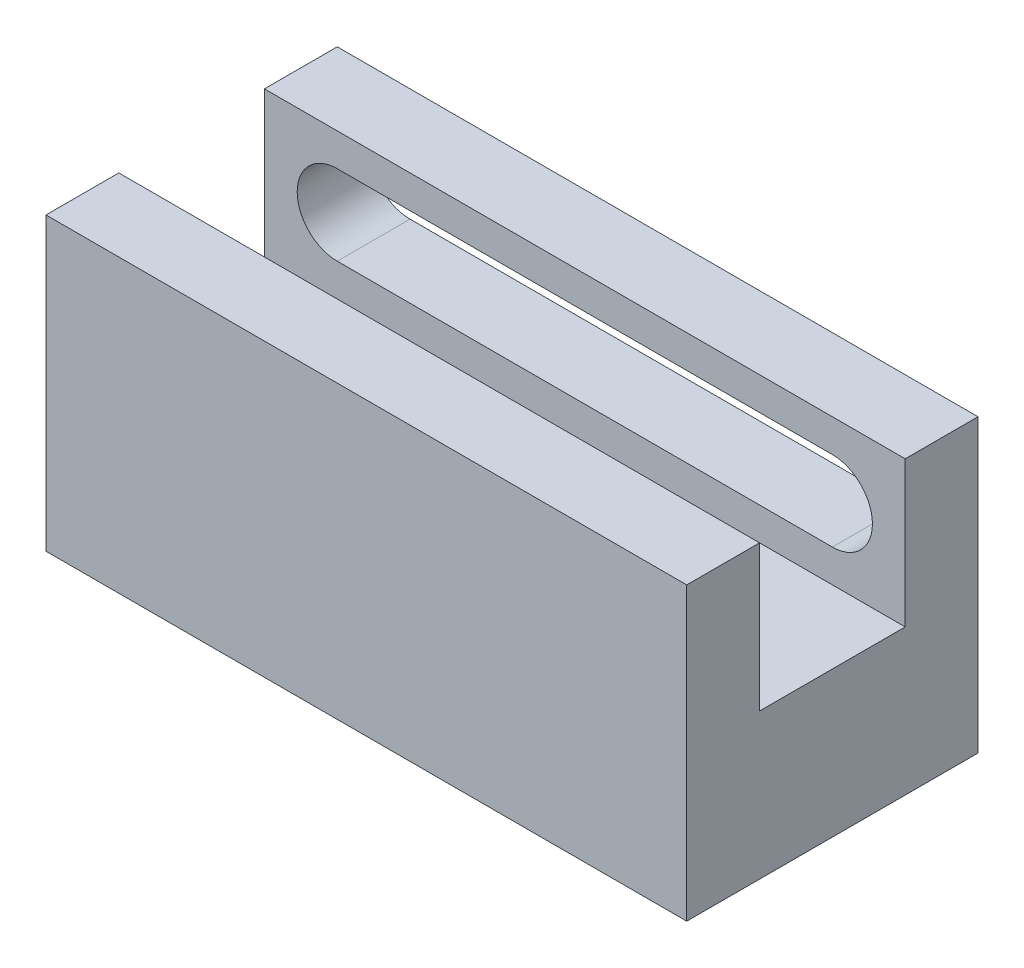
ISO-10303-21;
HEADER;
FILE_DESCRIPTION(('STEP AP214'),'2;1');
FILE_NAME('part.step','',(''),(''),'','','');
FILE_SCHEMA(('AUTOMOTIVE_DESIGN { 1 0 10303 214 1 1 1 1 }'));
ENDSEC;
DATA;
#1=APPLICATION_CONTEXT('core data for automotive mechanical design processes');
#2=APPLICATION_PROTOCOL_DEFINITION('international standard','automotive_design',2000,#1);
#3=PRODUCT_CONTEXT('',#1,'mechanical');
#4=PRODUCT('Part','Part','',(#3));
#5=PRODUCT_RELATED_PRODUCT_CATEGORY('part','',(#4));
#6=PRODUCT_DEFINITION_FORMATION('','',#4);
#7=PRODUCT_DEFINITION_CONTEXT('part definition',#1,'design');
#8=PRODUCT_DEFINITION('design','',#6,#7);
#9=PRODUCT_DEFINITION_SHAPE('','',#8);
#10=(LENGTH_UNIT() NAMED_UNIT(*) SI_UNIT(.MILLI.,.METRE.));
#11=(NAMED_UNIT(*) PLANE_ANGLE_UNIT() SI_UNIT($,.RADIAN.));
#12=(NAMED_UNIT(*) SI_UNIT($,.STERADIAN.) SOLID_ANGLE_UNIT());
#13=UNCERTAINTY_MEASURE_WITH_UNIT(LENGTH_MEASURE(1.E-05),#10,'distance_accuracy_value','');
#14=(GEOMETRIC_REPRESENTATION_CONTEXT(3) GLOBAL_UNCERTAINTY_ASSIGNED_CONTEXT((#13)) GLOBAL_UNIT_ASSIGNED_CONTEXT((#10,
#11,#12)) REPRESENTATION_CONTEXT('',''));
#15=CARTESIAN_POINT('',(0.,0.,0.));
#16=DIRECTION('',(0.,0.,1.));
#17=DIRECTION('',(1.,0.,0.));
#18=AXIS2_PLACEMENT_3D('',#15,#16,#17);
#19=CARTESIAN_POINT('',(0.,10.,0.));
#20=DIRECTION('',(0.,1.,0.));
#21=DIRECTION('',(0.,0.,1.));
#22=AXIS2_PLACEMENT_3D('',#19,#20,#21);
#23=PLANE('',#22);
#24=DIRECTION('',(0.,0.,-1.));
#25=VECTOR('',#24,1.);
#26=CARTESIAN_POINT('',(44.,10.,0.));
#27=LINE('',#26,#25);
#28=CARTESIAN_POINT('',(44.,10.,-4.99999999999999));
#29=VERTEX_POINT('',#28);
#30=CARTESIAN_POINT('',(44.,10.,-15.));
#31=VERTEX_POINT('',#30);
#32=EDGE_CURVE('E140',#29,#31,#27,.T.);
#33=ORIENTED_EDGE('',*,*,#32,.T.);
#34=DIRECTION('',(1.,0.,0.));
#35=VECTOR('',#34,1.);
#36=CARTESIAN_POINT('',(44.,10.,-15.));
#37=LINE('',#36,#35);
#38=CARTESIAN_POINT('',(0.,10.,-15.));
#39=VERTEX_POINT('',#38);
#40=EDGE_CURVE('E149',#39,#31,#37,.T.);
#41=ORIENTED_EDGE('',*,*,#40,.F.);
#42=DIRECTION('',(0.,0.,1.));
#43=VECTOR('',#42,1.);
#44=CARTESIAN_POINT('',(0.,10.,0.));
#45=LINE('',#44,#43);
#46=CARTESIAN_POINT('',(0.,10.,-4.99999999999999));
#47=VERTEX_POINT('',#46);
#48=EDGE_CURVE('E142',#39,#47,#45,.T.);
#49=ORIENTED_EDGE('',*,*,#48,.T.);
#50=DIRECTION('',(-1.,0.,0.));
#51=VECTOR('',#50,1.);
#52=CARTESIAN_POINT('',(0.,10.,-4.99999999999999));
#53=LINE('',#52,#51);
#54=EDGE_CURVE('E137',#29,#47,#53,.T.);
#55=ORIENTED_EDGE('',*,*,#54,.F.);
#56=EDGE_LOOP('',(#33,#41,#49,#55));
#57=FACE_BOUND('',#56,.T.);
#58=ADVANCED_FACE('F42',(#57),#23,.T.);
#59=CARTESIAN_POINT('',(0.,0.,0.));
#60=DIRECTION('',(0.,1.,0.));
#61=DIRECTION('',(0.,0.,1.));
#62=AXIS2_PLACEMENT_3D('',#59,#60,#61);
#63=PLANE('',#62);
#64=DIRECTION('',(0.,0.,1.));
#65=VECTOR('',#64,1.);
#66=CARTESIAN_POINT('',(0.,0.,-20.));
#67=LINE('',#66,#65);
#68=CARTESIAN_POINT('',(0.,0.,-20.));
#69=VERTEX_POINT('',#68);
#70=CARTESIAN_POINT('',(0.,0.,0.));
#71=VERTEX_POINT('',#70);
#72=EDGE_CURVE('E180',#69,#71,#67,.T.);
#73=ORIENTED_EDGE('',*,*,#72,.F.);
#74=DIRECTION('',(-1.,0.,0.));
#75=VECTOR('',#74,1.);
#76=CARTESIAN_POINT('',(0.,0.,-20.));
#77=LINE('',#76,#75);
#78=CARTESIAN_POINT('',(44.,0.,-20.));
#79=VERTEX_POINT('',#78);
#80=EDGE_CURVE('E190',#79,#69,#77,.T.);
#81=ORIENTED_EDGE('',*,*,#80,.F.);
#82=DIRECTION('',(0.,0.,-1.));
#83=VECTOR('',#82,1.);
#84=CARTESIAN_POINT('',(44.,0.,-20.));
#85=LINE('',#84,#83);
#86=CARTESIAN_POINT('',(44.,0.,0.));
#87=VERTEX_POINT('',#86);
#88=EDGE_CURVE('E187',#87,#79,#85,.T.);
#89=ORIENTED_EDGE('',*,*,#88,.F.);
#90=DIRECTION('',(1.,0.,0.));
#91=VECTOR('',#90,1.);
#92=CARTESIAN_POINT('',(0.,0.,0.));
#93=LINE('',#92,#91);
#94=EDGE_CURVE('E184',#71,#87,#93,.T.);
#95=ORIENTED_EDGE('',*,*,#94,.F.);
#96=EDGE_LOOP('',(#73,#81,#89,#95));
#97=FACE_BOUND('',#96,.T.);
#98=CARTESIAN_POINT('',(22.,0.,-10.));
#99=DIRECTION('',(0.,1.,0.));
#100=DIRECTION('',(0.,0.,1.));
#101=AXIS2_PLACEMENT_3D('',#98,#99,#100);
#102=CIRCLE('',#101,2.55);
#103=CARTESIAN_POINT('',(22.,0.,-7.45));
#104=VERTEX_POINT('',#103);
#105=EDGE_CURVE('E176',#104,#104,#102,.T.);
#106=ORIENTED_EDGE('',*,*,#105,.T.);
#107=EDGE_LOOP('',(#106));
#108=FACE_BOUND('',#107,.T.);
#109=ADVANCED_FACE('F263',(#97,#108),#63,.F.);
#110=CARTESIAN_POINT('',(0.,7.5,-20.));
#111=DIRECTION('',(1.,0.,0.));
#112=DIRECTION('',(0.,0.,-1.));
#113=AXIS2_PLACEMENT_3D('',#110,#111,#112);
#114=PLANE('',#113);
#115=ORIENTED_EDGE('',*,*,#72,.T.);
#116=DIRECTION('',(0.,-1.,0.));
#117=VECTOR('',#116,1.);
#118=CARTESIAN_POINT('',(0.,7.5,0.));
#119=LINE('',#118,#117);
#120=CARTESIAN_POINT('',(0.,20.,0.));
#121=VERTEX_POINT('',#120);
#122=EDGE_CURVE('E11',#121,#71,#119,.T.);
#123=ORIENTED_EDGE('',*,*,#122,.F.);
#124=DIRECTION('',(0.,0.,1.));
#125=VECTOR('',#124,1.);
#126=CARTESIAN_POINT('',(0.,20.,-4.99999999999999));
#127=LINE('',#126,#125);
#128=CARTESIAN_POINT('',(0.,20.,-4.99999999999999));
#129=VERTEX_POINT('',#128);
#130=EDGE_CURVE('E148',#129,#121,#127,.T.);
#131=ORIENTED_EDGE('',*,*,#130,.F.);
#132=DIRECTION('',(0.,-1.,0.));
#133=VECTOR('',#132,1.);
#134=CARTESIAN_POINT('',(0.,20.,-4.99999999999999));
#135=LINE('',#134,#133);
#136=EDGE_CURVE('E165',#129,#47,#135,.T.);
#137=ORIENTED_EDGE('',*,*,#136,.T.);
#138=ORIENTED_EDGE('',*,*,#48,.F.);
#139=DIRECTION('',(0.,-1.,0.));
#140=VECTOR('',#139,1.);
#141=CARTESIAN_POINT('',(0.,20.,-15.));
#142=LINE('',#141,#140);
#143=CARTESIAN_POINT('',(0.,20.,-15.));
#144=VERTEX_POINT('',#143);
#145=EDGE_CURVE('E213',#144,#39,#142,.T.);
#146=ORIENTED_EDGE('',*,*,#145,.F.);
#147=DIRECTION('',(0.,0.,1.));
#148=VECTOR('',#147,1.);
#149=CARTESIAN_POINT('',(0.,20.,-15.));
#150=LINE('',#149,#148);
#151=CARTESIAN_POINT('',(0.,20.,-20.));
#152=VERTEX_POINT('',#151);
#153=EDGE_CURVE('E232',#152,#144,#150,.T.);
#154=ORIENTED_EDGE('',*,*,#153,.F.);
#155=DIRECTION('',(0.,-1.,0.));
#156=VECTOR('',#155,1.);
#157=CARTESIAN_POINT('',(0.,7.5,-20.));
#158=LINE('',#157,#156);
#159=EDGE_CURVE('E193',#152,#69,#158,.T.);
#160=ORIENTED_EDGE('',*,*,#159,.T.);
#161=EDGE_LOOP('',(#115,#123,#131,#137,#138,#146,#154,#160));
#162=FACE_BOUND('',#161,.T.);
#163=ADVANCED_FACE('F44',(#162),#114,.F.);
#164=CARTESIAN_POINT('',(0.,7.5,0.));
#165=DIRECTION('',(0.,0.,-1.));
#166=DIRECTION('',(-1.,0.,0.));
#167=AXIS2_PLACEMENT_3D('',#164,#165,#166);
#168=PLANE('',#167);
#169=ORIENTED_EDGE('',*,*,#94,.T.);
#170=DIRECTION('',(0.,-1.,0.));
#171=VECTOR('',#170,1.);
#172=CARTESIAN_POINT('',(44.,7.5,0.));
#173=LINE('',#172,#171);
#174=CARTESIAN_POINT('',(44.,20.,0.));
#175=VERTEX_POINT('',#174);
#176=EDGE_CURVE('E52',#175,#87,#173,.T.);
#177=ORIENTED_EDGE('',*,*,#176,.F.);
#178=DIRECTION('',(1.,0.,0.));
#179=VECTOR('',#178,1.);
#180=CARTESIAN_POINT('',(0.,20.,0.));
#181=LINE('',#180,#179);
#182=EDGE_CURVE('E244',#121,#175,#181,.T.);
#183=ORIENTED_EDGE('',*,*,#182,.F.);
#184=ORIENTED_EDGE('',*,*,#122,.T.);
#185=EDGE_LOOP('',(#169,#177,#183,#184));
#186=FACE_BOUND('',#185,.T.);
#187=ADVANCED_FACE('F259',(#186),#168,.F.);
#188=CARTESIAN_POINT('',(44.,7.5,-20.));
#189=DIRECTION('',(-1.,0.,0.));
#190=DIRECTION('',(0.,0.,1.));
#191=AXIS2_PLACEMENT_3D('',#188,#189,#190);
#192=PLANE('',#191);
#193=ORIENTED_EDGE('',*,*,#88,.T.);
#194=DIRECTION('',(0.,-1.,0.));
#195=VECTOR('',#194,1.);
#196=CARTESIAN_POINT('',(44.,7.5,-20.));
#197=LINE('',#196,#195);
#198=CARTESIAN_POINT('',(44.,20.,-20.));
#199=VERTEX_POINT('',#198);
#200=EDGE_CURVE('E197',#199,#79,#197,.T.);
#201=ORIENTED_EDGE('',*,*,#200,.F.);
#202=DIRECTION('',(0.,0.,-1.));
#203=VECTOR('',#202,1.);
#204=CARTESIAN_POINT('',(44.,20.,-15.));
#205=LINE('',#204,#203);
#206=CARTESIAN_POINT('',(44.,20.,-15.));
#207=VERTEX_POINT('',#206);
#208=EDGE_CURVE('E229',#207,#199,#205,.T.);
#209=ORIENTED_EDGE('',*,*,#208,.F.);
#210=DIRECTION('',(0.,-1.,0.));
#211=VECTOR('',#210,1.);
#212=CARTESIAN_POINT('',(44.,20.,-15.));
#213=LINE('',#212,#211);
#214=EDGE_CURVE('E159',#207,#31,#213,.T.);
#215=ORIENTED_EDGE('',*,*,#214,.T.);
#216=ORIENTED_EDGE('',*,*,#32,.F.);
#217=DIRECTION('',(0.,-1.,0.));
#218=VECTOR('',#217,1.);
#219=CARTESIAN_POINT('',(44.,20.,-4.99999999999999));
#220=LINE('',#219,#218);
#221=CARTESIAN_POINT('',(44.,20.,-4.99999999999999));
#222=VERTEX_POINT('',#221);
#223=EDGE_CURVE('E156',#222,#29,#220,.T.);
#224=ORIENTED_EDGE('',*,*,#223,.F.);
#225=DIRECTION('',(0.,0.,-1.));
#226=VECTOR('',#225,1.);
#227=CARTESIAN_POINT('',(44.,20.,-4.99999999999999));
#228=LINE('',#227,#226);
#229=EDGE_CURVE('E248',#175,#222,#228,.T.);
#230=ORIENTED_EDGE('',*,*,#229,.F.);
#231=ORIENTED_EDGE('',*,*,#176,.T.);
#232=EDGE_LOOP('',(#193,#201,#209,#215,#216,#224,#230,#231));
#233=FACE_BOUND('',#232,.T.);
#234=ADVANCED_FACE('F154',(#233),#192,.F.);
#235=CARTESIAN_POINT('',(0.,7.5,-20.));
#236=DIRECTION('',(0.,0.,1.));
#237=DIRECTION('',(1.,0.,0.));
#238=AXIS2_PLACEMENT_3D('',#235,#236,#237);
#239=PLANE('',#238);
#240=CARTESIAN_POINT('',(5.,15.,-20.));
#241=DIRECTION('',(0.,0.,-1.));
#242=DIRECTION('',(-1.,0.,0.));
#243=AXIS2_PLACEMENT_3D('',#240,#241,#242);
#244=CIRCLE('',#243,2.75);
#245=CARTESIAN_POINT('',(5.,12.25,-20.));
#246=VERTEX_POINT('',#245);
#247=CARTESIAN_POINT('',(5.,17.75,-20.));
#248=VERTEX_POINT('',#247);
#249=EDGE_CURVE('E204',#246,#248,#244,.T.);
#250=ORIENTED_EDGE('',*,*,#249,.F.);
#251=DIRECTION('',(1.,0.,0.));
#252=VECTOR('',#251,1.);
#253=CARTESIAN_POINT('',(0.,12.25,-20.));
#254=LINE('',#253,#252);
#255=CARTESIAN_POINT('',(39.,12.25,-20.));
#256=VERTEX_POINT('',#255);
#257=EDGE_CURVE('E46',#256,#246,#254,.F.);
#258=ORIENTED_EDGE('',*,*,#257,.F.);
#259=CARTESIAN_POINT('',(39.,15.,-20.));
#260=DIRECTION('',(0.,0.,-1.));
#261=DIRECTION('',(-1.,0.,0.));
#262=AXIS2_PLACEMENT_3D('',#259,#260,#261);
#263=CIRCLE('',#262,2.74999999999999);
#264=CARTESIAN_POINT('',(39.,17.75,-20.));
#265=VERTEX_POINT('',#264);
#266=EDGE_CURVE('E85',#265,#256,#263,.T.);
#267=ORIENTED_EDGE('',*,*,#266,.F.);
#268=DIRECTION('',(1.,0.,0.));
#269=VECTOR('',#268,1.);
#270=CARTESIAN_POINT('',(0.,17.75,-20.));
#271=LINE('',#270,#269);
#272=EDGE_CURVE('E207',#265,#248,#271,.F.);
#273=ORIENTED_EDGE('',*,*,#272,.T.);
#274=EDGE_LOOP('',(#250,#258,#267,#273));
#275=FACE_BOUND('',#274,.T.);
#276=ORIENTED_EDGE('',*,*,#80,.T.);
#277=ORIENTED_EDGE('',*,*,#159,.F.);
#278=DIRECTION('',(-1.,0.,0.));
#279=VECTOR('',#278,1.);
#280=CARTESIAN_POINT('',(44.,20.,-20.));
#281=LINE('',#280,#279);
#282=EDGE_CURVE('E235',#199,#152,#281,.T.);
#283=ORIENTED_EDGE('',*,*,#282,.F.);
#284=ORIENTED_EDGE('',*,*,#200,.T.);
#285=EDGE_LOOP('',(#276,#277,#283,#284));
#286=FACE_BOUND('',#285,.T.);
#287=ADVANCED_FACE('F266',(#275,#286),#239,.F.);
#288=CARTESIAN_POINT('',(22.,7.5,-10.));
#289=DIRECTION('',(0.,-1.,0.));
#290=DIRECTION('',(0.,0.,-1.));
#291=AXIS2_PLACEMENT_3D('',#288,#289,#290);
#292=CYLINDRICAL_SURFACE('',#291,2.55);
#293=CARTESIAN_POINT('',(22.,7.5,-10.));
#294=DIRECTION('',(0.,1.,0.));
#295=DIRECTION('',(0.,0.,1.));
#296=AXIS2_PLACEMENT_3D('',#293,#294,#295);
#297=CIRCLE('',#296,2.55);
#298=CARTESIAN_POINT('',(22.,7.5,-7.45));
#299=VERTEX_POINT('',#298);
#300=EDGE_CURVE('E172',#299,#299,#297,.T.);
#301=ORIENTED_EDGE('',*,*,#300,.T.);
#302=EDGE_LOOP('',(#301));
#303=FACE_BOUND('',#302,.T.);
#304=ORIENTED_EDGE('',*,*,#105,.F.);
#305=EDGE_LOOP('',(#304));
#306=FACE_BOUND('',#305,.T.);
#307=ADVANCED_FACE('F294',(#303,#306),#292,.F.);
#308=CARTESIAN_POINT('',(0.,7.5,0.));
#309=DIRECTION('',(0.,1.,0.));
#310=DIRECTION('',(0.,0.,1.));
#311=AXIS2_PLACEMENT_3D('',#308,#309,#310);
#312=PLANE('',#311);
#313=ORIENTED_EDGE('',*,*,#300,.F.);
#314=EDGE_LOOP('',(#313));
#315=FACE_BOUND('',#314,.T.);
#316=ADVANCED_FACE('F291',(#315),#312,.F.);
#317=CARTESIAN_POINT('',(0.,20.,-4.99999999999999));
#318=DIRECTION('',(0.,0.,1.));
#319=DIRECTION('',(1.,0.,0.));
#320=AXIS2_PLACEMENT_3D('',#317,#318,#319);
#321=PLANE('',#320);
#322=ORIENTED_EDGE('',*,*,#54,.T.);
#323=ORIENTED_EDGE('',*,*,#136,.F.);
#324=DIRECTION('',(-1.,0.,0.));
#325=VECTOR('',#324,1.);
#326=CARTESIAN_POINT('',(0.,20.,-4.99999999999999));
#327=LINE('',#326,#325);
#328=EDGE_CURVE('E163',#222,#129,#327,.T.);
#329=ORIENTED_EDGE('',*,*,#328,.F.);
#330=ORIENTED_EDGE('',*,*,#223,.T.);
#331=EDGE_LOOP('',(#322,#323,#329,#330));
#332=FACE_BOUND('',#331,.T.);
#333=ADVANCED_FACE('F162',(#332),#321,.F.);
#334=CARTESIAN_POINT('',(0.,20.,0.));
#335=DIRECTION('',(0.,1.,0.));
#336=DIRECTION('',(0.,0.,1.));
#337=AXIS2_PLACEMENT_3D('',#334,#335,#336);
#338=PLANE('',#337);
#339=ORIENTED_EDGE('',*,*,#130,.T.);
#340=ORIENTED_EDGE('',*,*,#182,.T.);
#341=ORIENTED_EDGE('',*,*,#229,.T.);
#342=ORIENTED_EDGE('',*,*,#328,.T.);
#343=EDGE_LOOP('',(#339,#340,#341,#342));
#344=FACE_BOUND('',#343,.T.);
#345=ADVANCED_FACE('F253',(#344),#338,.T.);
#346=CARTESIAN_POINT('',(44.,20.,-15.));
#347=DIRECTION('',(0.,0.,-1.));
#348=DIRECTION('',(-1.,0.,0.));
#349=AXIS2_PLACEMENT_3D('',#346,#347,#348);
#350=PLANE('',#349);
#351=CARTESIAN_POINT('',(39.,15.,-15.));
#352=DIRECTION('',(0.,0.,-1.));
#353=DIRECTION('',(-1.,0.,0.));
#354=AXIS2_PLACEMENT_3D('',#351,#352,#353);
#355=CIRCLE('',#354,2.74999999999999);
#356=CARTESIAN_POINT('',(39.,17.75,-15.));
#357=VERTEX_POINT('',#356);
#358=CARTESIAN_POINT('',(39.,12.25,-15.));
#359=VERTEX_POINT('',#358);
#360=EDGE_CURVE('E475',#357,#359,#355,.T.);
#361=ORIENTED_EDGE('',*,*,#360,.T.);
#362=DIRECTION('',(-1.,0.,0.));
#363=VECTOR('',#362,1.);
#364=CARTESIAN_POINT('',(0.,12.25,-15.));
#365=LINE('',#364,#363);
#366=CARTESIAN_POINT('',(5.,12.25,-15.));
#367=VERTEX_POINT('',#366);
#368=EDGE_CURVE('E493',#359,#367,#365,.T.);
#369=ORIENTED_EDGE('',*,*,#368,.T.);
#370=CARTESIAN_POINT('',(5.,15.,-15.));
#371=DIRECTION('',(0.,0.,-1.));
#372=DIRECTION('',(-1.,0.,0.));
#373=AXIS2_PLACEMENT_3D('',#370,#371,#372);
#374=CIRCLE('',#373,2.75);
#375=CARTESIAN_POINT('',(5.,17.75,-15.));
#376=VERTEX_POINT('',#375);
#377=EDGE_CURVE('E489',#367,#376,#374,.T.);
#378=ORIENTED_EDGE('',*,*,#377,.T.);
#379=DIRECTION('',(-1.,0.,0.));
#380=VECTOR('',#379,1.);
#381=CARTESIAN_POINT('',(0.,17.75,-15.));
#382=LINE('',#381,#380);
#383=EDGE_CURVE('E486',#357,#376,#382,.T.);
#384=ORIENTED_EDGE('',*,*,#383,.F.);
#385=EDGE_LOOP('',(#361,#369,#378,#384));
#386=FACE_BOUND('',#385,.T.);
#387=ORIENTED_EDGE('',*,*,#40,.T.);
#388=ORIENTED_EDGE('',*,*,#214,.F.);
#389=DIRECTION('',(1.,0.,0.));
#390=VECTOR('',#389,1.);
#391=CARTESIAN_POINT('',(44.,20.,-15.));
#392=LINE('',#391,#390);
#393=EDGE_CURVE('E94',#144,#207,#392,.T.);
#394=ORIENTED_EDGE('',*,*,#393,.F.);
#395=ORIENTED_EDGE('',*,*,#145,.T.);
#396=EDGE_LOOP('',(#387,#388,#394,#395));
#397=FACE_BOUND('',#396,.T.);
#398=ADVANCED_FACE('F272',(#386,#397),#350,.F.);
#399=CARTESIAN_POINT('',(0.,20.,0.));
#400=DIRECTION('',(0.,1.,0.));
#401=DIRECTION('',(0.,0.,1.));
#402=AXIS2_PLACEMENT_3D('',#399,#400,#401);
#403=PLANE('',#402);
#404=ORIENTED_EDGE('',*,*,#208,.T.);
#405=ORIENTED_EDGE('',*,*,#282,.T.);
#406=ORIENTED_EDGE('',*,*,#153,.T.);
#407=ORIENTED_EDGE('',*,*,#393,.T.);
#408=EDGE_LOOP('',(#404,#405,#406,#407));
#409=FACE_BOUND('',#408,.T.);
#410=ADVANCED_FACE('F269',(#409),#403,.T.);
#411=CARTESIAN_POINT('',(0.,12.25,-15.));
#412=DIRECTION('',(0.,-1.,0.));
#413=DIRECTION('',(0.,0.,-1.));
#414=AXIS2_PLACEMENT_3D('',#411,#412,#413);
#415=PLANE('',#414);
#416=DIRECTION('',(0.,0.,-1.));
#417=VECTOR('',#416,1.);
#418=CARTESIAN_POINT('',(5.,12.25,-15.));
#419=LINE('',#418,#417);
#420=EDGE_CURVE('E60',#367,#246,#419,.T.);
#421=ORIENTED_EDGE('',*,*,#420,.F.);
#422=ORIENTED_EDGE('',*,*,#368,.F.);
#423=DIRECTION('',(0.,0.,-1.));
#424=VECTOR('',#423,1.);
#425=CARTESIAN_POINT('',(39.,12.25,-15.));
#426=LINE('',#425,#424);
#427=EDGE_CURVE('E208',#359,#256,#426,.T.);
#428=ORIENTED_EDGE('',*,*,#427,.T.);
#429=ORIENTED_EDGE('',*,*,#257,.T.);
#430=EDGE_LOOP('',(#421,#422,#428,#429));
#431=FACE_BOUND('',#430,.T.);
#432=ADVANCED_FACE('F271',(#431),#415,.F.);
#433=CARTESIAN_POINT('',(39.,15.,-15.));
#434=DIRECTION('',(0.,0.,-1.));
#435=DIRECTION('',(-1.,0.,0.));
#436=AXIS2_PLACEMENT_3D('',#433,#434,#435);
#437=CYLINDRICAL_SURFACE('',#436,2.74999999999999);
#438=ORIENTED_EDGE('',*,*,#427,.F.);
#439=ORIENTED_EDGE('',*,*,#360,.F.);
#440=DIRECTION('',(0.,0.,-1.));
#441=VECTOR('',#440,1.);
#442=CARTESIAN_POINT('',(39.,17.75,-15.));
#443=LINE('',#442,#441);
#444=EDGE_CURVE('E472',#357,#265,#443,.T.);
#445=ORIENTED_EDGE('',*,*,#444,.T.);
#446=ORIENTED_EDGE('',*,*,#266,.T.);
#447=EDGE_LOOP('',(#438,#439,#445,#446));
#448=FACE_BOUND('',#447,.T.);
#449=ADVANCED_FACE('F278',(#448),#437,.F.);
#450=CARTESIAN_POINT('',(0.,17.75,-15.));
#451=DIRECTION('',(0.,-1.,0.));
#452=DIRECTION('',(1.,0.,0.));
#453=AXIS2_PLACEMENT_3D('',#450,#451,#452);
#454=PLANE('',#453);
#455=ORIENTED_EDGE('',*,*,#272,.F.);
#456=ORIENTED_EDGE('',*,*,#444,.F.);
#457=ORIENTED_EDGE('',*,*,#383,.T.);
#458=DIRECTION('',(0.,0.,-1.));
#459=VECTOR('',#458,1.);
#460=CARTESIAN_POINT('',(5.,17.75,-15.));
#461=LINE('',#460,#459);
#462=EDGE_CURVE('E66',#376,#248,#461,.T.);
#463=ORIENTED_EDGE('',*,*,#462,.T.);
#464=EDGE_LOOP('',(#455,#456,#457,#463));
#465=FACE_BOUND('',#464,.T.);
#466=ADVANCED_FACE('F381',(#465),#454,.T.);
#467=CARTESIAN_POINT('',(5.,15.,-15.));
#468=DIRECTION('',(0.,0.,-1.));
#469=DIRECTION('',(-1.,0.,0.));
#470=AXIS2_PLACEMENT_3D('',#467,#468,#469);
#471=CYLINDRICAL_SURFACE('',#470,2.75);
#472=ORIENTED_EDGE('',*,*,#462,.F.);
#473=ORIENTED_EDGE('',*,*,#377,.F.);
#474=ORIENTED_EDGE('',*,*,#420,.T.);
#475=ORIENTED_EDGE('',*,*,#249,.T.);
#476=EDGE_LOOP('',(#472,#473,#474,#475));
#477=FACE_BOUND('',#476,.T.);
#478=ADVANCED_FACE('F390',(#477),#471,.F.);
#479=CLOSED_SHELL('',(#58,#109,#163,#187,#234,#287,#307,#316,#333,#345,#398,#410,#432,#449,#466,#478));
#480=MANIFOLD_SOLID_BREP('B2',#479);
#481=ADVANCED_BREP_SHAPE_REPRESENTATION('',(#18,#480),#14);
#482=SHAPE_DEFINITION_REPRESENTATION(#9,#481);
ENDSEC;
END-ISO-10303-21;
